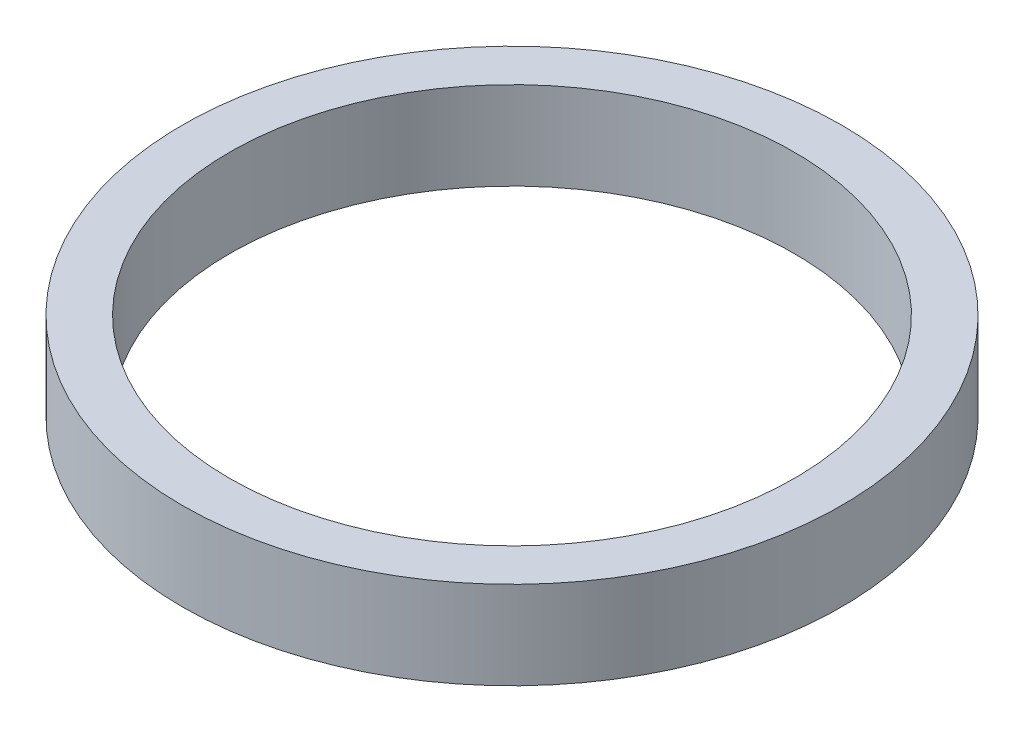
ISO-10303-21;
HEADER;
FILE_DESCRIPTION(('STEP AP214'),'2;1');
FILE_NAME('part.step','',(''),(''),'','','');
FILE_SCHEMA(('AUTOMOTIVE_DESIGN { 1 0 10303 214 1 1 1 1 }'));
ENDSEC;
DATA;
#1=APPLICATION_CONTEXT('core data for automotive mechanical design processes');
#2=APPLICATION_PROTOCOL_DEFINITION('international standard','automotive_design',2000,#1);
#3=PRODUCT_CONTEXT('',#1,'mechanical');
#4=PRODUCT('Part','Part','',(#3));
#5=PRODUCT_RELATED_PRODUCT_CATEGORY('part','',(#4));
#6=PRODUCT_DEFINITION_FORMATION('','',#4);
#7=PRODUCT_DEFINITION_CONTEXT('part definition',#1,'design');
#8=PRODUCT_DEFINITION('design','',#6,#7);
#9=PRODUCT_DEFINITION_SHAPE('','',#8);
#10=(LENGTH_UNIT() NAMED_UNIT(*) SI_UNIT(.MILLI.,.METRE.));
#11=(NAMED_UNIT(*) PLANE_ANGLE_UNIT() SI_UNIT($,.RADIAN.));
#12=(NAMED_UNIT(*) SI_UNIT($,.STERADIAN.) SOLID_ANGLE_UNIT());
#13=UNCERTAINTY_MEASURE_WITH_UNIT(LENGTH_MEASURE(1.E-05),#10,'distance_accuracy_value','');
#14=(GEOMETRIC_REPRESENTATION_CONTEXT(3) GLOBAL_UNCERTAINTY_ASSIGNED_CONTEXT((#13)) GLOBAL_UNIT_ASSIGNED_CONTEXT((#10,
#11,#12)) REPRESENTATION_CONTEXT('',''));
#15=CARTESIAN_POINT('',(0.,0.,0.));
#16=DIRECTION('',(0.,0.,1.));
#17=DIRECTION('',(1.,0.,0.));
#18=AXIS2_PLACEMENT_3D('',#15,#16,#17);
#19=CARTESIAN_POINT('',(0.,14.,0.));
#20=DIRECTION('',(0.,-1.,0.));
#21=DIRECTION('',(0.,0.,-1.));
#22=AXIS2_PLACEMENT_3D('',#19,#20,#21);
#23=CYLINDRICAL_SURFACE('',#22,52.5);
#24=CARTESIAN_POINT('',(0.,14.,0.));
#25=DIRECTION('',(0.,1.,0.));
#26=DIRECTION('',(0.,0.,1.));
#27=AXIS2_PLACEMENT_3D('',#24,#25,#26);
#28=CIRCLE('',#27,52.5);
#29=CARTESIAN_POINT('',(0.,14.,52.5));
#30=VERTEX_POINT('',#29);
#31=EDGE_CURVE('E10',#30,#30,#28,.T.);
#32=ORIENTED_EDGE('',*,*,#31,.F.);
#33=EDGE_LOOP('',(#32));
#34=FACE_BOUND('',#33,.T.);
#35=CARTESIAN_POINT('',(0.,0.,0.));
#36=DIRECTION('',(0.,1.,0.));
#37=DIRECTION('',(0.,0.,1.));
#38=AXIS2_PLACEMENT_3D('',#35,#36,#37);
#39=CIRCLE('',#38,52.5);
#40=CARTESIAN_POINT('',(0.,0.,52.5));
#41=VERTEX_POINT('',#40);
#42=EDGE_CURVE('E37',#41,#41,#39,.T.);
#43=ORIENTED_EDGE('',*,*,#42,.T.);
#44=EDGE_LOOP('',(#43));
#45=FACE_BOUND('',#44,.T.);
#46=ADVANCED_FACE('F40',(#34,#45),#23,.T.);
#47=CARTESIAN_POINT('',(0.,14.,0.));
#48=DIRECTION('',(0.,1.,0.));
#49=DIRECTION('',(0.,0.,1.));
#50=AXIS2_PLACEMENT_3D('',#47,#48,#49);
#51=PLANE('',#50);
#52=CARTESIAN_POINT('',(0.,14.,0.));
#53=DIRECTION('',(0.,1.,0.));
#54=DIRECTION('',(0.,0.,1.));
#55=AXIS2_PLACEMENT_3D('',#52,#53,#54);
#56=CIRCLE('',#55,45.);
#57=CARTESIAN_POINT('',(0.,14.,45.));
#58=VERTEX_POINT('',#57);
#59=EDGE_CURVE('E50',#58,#58,#56,.T.);
#60=ORIENTED_EDGE('',*,*,#59,.F.);
#61=EDGE_LOOP('',(#60));
#62=FACE_BOUND('',#61,.T.);
#63=ORIENTED_EDGE('',*,*,#31,.T.);
#64=EDGE_LOOP('',(#63));
#65=FACE_BOUND('',#64,.T.);
#66=ADVANCED_FACE('F59',(#62,#65),#51,.T.);
#67=CARTESIAN_POINT('',(0.,0.,0.));
#68=DIRECTION('',(0.,1.,0.));
#69=DIRECTION('',(0.,0.,1.));
#70=AXIS2_PLACEMENT_3D('',#67,#68,#69);
#71=PLANE('',#70);
#72=CARTESIAN_POINT('',(0.,0.,0.));
#73=DIRECTION('',(0.,1.,0.));
#74=DIRECTION('',(0.,0.,1.));
#75=AXIS2_PLACEMENT_3D('',#72,#73,#74);
#76=CIRCLE('',#75,45.);
#77=CARTESIAN_POINT('',(0.,0.,45.));
#78=VERTEX_POINT('',#77);
#79=EDGE_CURVE('E47',#78,#78,#76,.T.);
#80=ORIENTED_EDGE('',*,*,#79,.T.);
#81=EDGE_LOOP('',(#80));
#82=FACE_BOUND('',#81,.T.);
#83=ORIENTED_EDGE('',*,*,#42,.F.);
#84=EDGE_LOOP('',(#83));
#85=FACE_BOUND('',#84,.T.);
#86=ADVANCED_FACE('F58',(#82,#85),#71,.F.);
#87=CARTESIAN_POINT('',(0.,14.,0.));
#88=DIRECTION('',(0.,-1.,0.));
#89=DIRECTION('',(0.,0.,-1.));
#90=AXIS2_PLACEMENT_3D('',#87,#88,#89);
#91=CYLINDRICAL_SURFACE('',#90,45.);
#92=ORIENTED_EDGE('',*,*,#59,.T.);
#93=EDGE_LOOP('',(#92));
#94=FACE_BOUND('',#93,.T.);
#95=ORIENTED_EDGE('',*,*,#79,.F.);
#96=EDGE_LOOP('',(#95));
#97=FACE_BOUND('',#96,.T.);
#98=ADVANCED_FACE('F54',(#94,#97),#91,.F.);
#99=CLOSED_SHELL('',(#46,#66,#86,#98));
#100=MANIFOLD_SOLID_BREP('B2',#99);
#101=ADVANCED_BREP_SHAPE_REPRESENTATION('',(#18,#100),#14);
#102=SHAPE_DEFINITION_REPRESENTATION(#9,#101);
ENDSEC;
END-ISO-10303-21;
